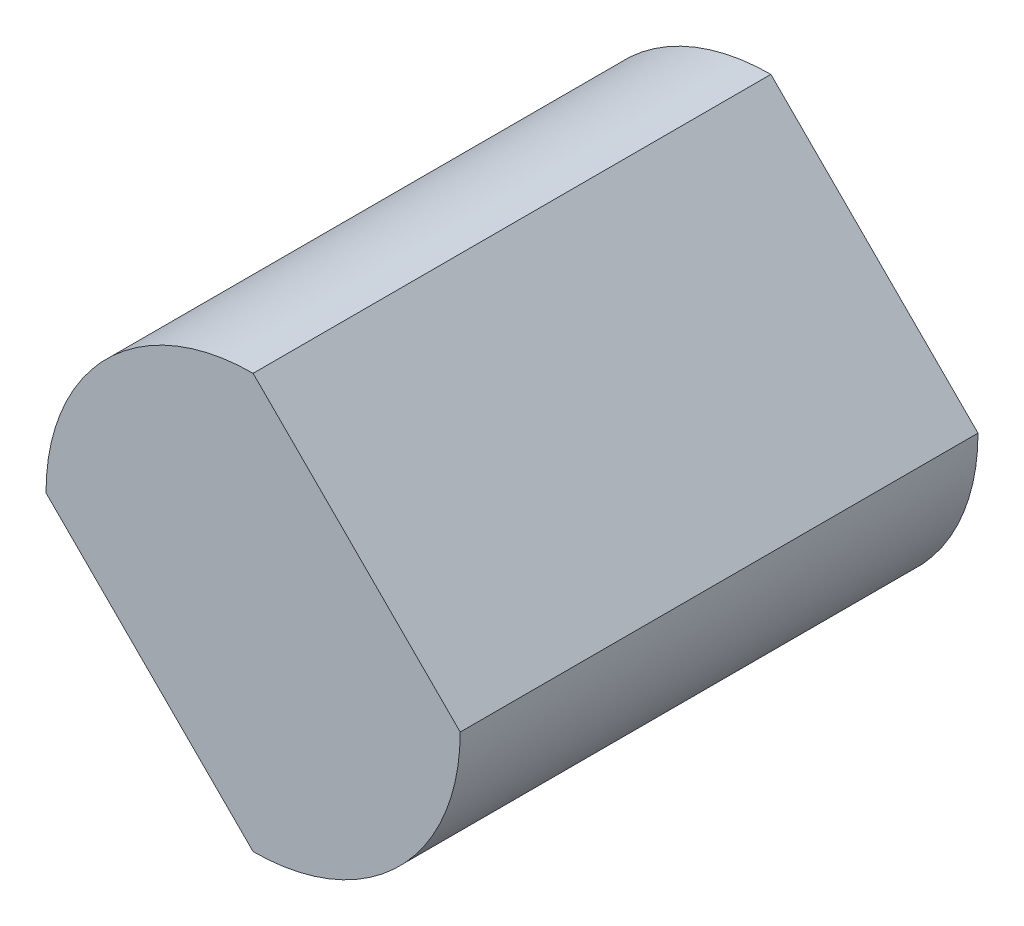
ISO-10303-21;
HEADER;
FILE_DESCRIPTION(('STEP AP214'),'2;1');
FILE_NAME('part.step','',(''),(''),'','','');
FILE_SCHEMA(('AUTOMOTIVE_DESIGN { 1 0 10303 214 1 1 1 1 }'));
ENDSEC;
DATA;
#1=APPLICATION_CONTEXT('core data for automotive mechanical design processes');
#2=APPLICATION_PROTOCOL_DEFINITION('international standard','automotive_design',2000,#1);
#3=PRODUCT_CONTEXT('',#1,'mechanical');
#4=PRODUCT('Part','Part','',(#3));
#5=PRODUCT_RELATED_PRODUCT_CATEGORY('part','',(#4));
#6=PRODUCT_DEFINITION_FORMATION('','',#4);
#7=PRODUCT_DEFINITION_CONTEXT('part definition',#1,'design');
#8=PRODUCT_DEFINITION('design','',#6,#7);
#9=PRODUCT_DEFINITION_SHAPE('','',#8);
#10=(LENGTH_UNIT() NAMED_UNIT(*) SI_UNIT(.MILLI.,.METRE.));
#11=(NAMED_UNIT(*) PLANE_ANGLE_UNIT() SI_UNIT($,.RADIAN.));
#12=(NAMED_UNIT(*) SI_UNIT($,.STERADIAN.) SOLID_ANGLE_UNIT());
#13=UNCERTAINTY_MEASURE_WITH_UNIT(LENGTH_MEASURE(1.E-05),#10,'distance_accuracy_value','');
#14=(GEOMETRIC_REPRESENTATION_CONTEXT(3) GLOBAL_UNCERTAINTY_ASSIGNED_CONTEXT((#13)) GLOBAL_UNIT_ASSIGNED_CONTEXT((#10,
#11,#12)) REPRESENTATION_CONTEXT('',''));
#15=CARTESIAN_POINT('',(0.,0.,0.));
#16=DIRECTION('',(0.,0.,1.));
#17=DIRECTION('',(1.,0.,0.));
#18=AXIS2_PLACEMENT_3D('',#15,#16,#17);
#19=CARTESIAN_POINT('',(-10.,-10.,25.));
#20=DIRECTION('',(0.707106781186548,0.707106781186547,0.));
#21=DIRECTION('',(-0.707106781186547,0.707106781186548,0.));
#22=AXIS2_PLACEMENT_3D('',#19,#20,#21);
#23=PLANE('',#22);
#24=DIRECTION('',(0.707106781186547,-0.707106781186548,0.));
#25=VECTOR('',#24,1.);
#26=CARTESIAN_POINT('',(-10.,-10.,0.));
#27=LINE('',#26,#25);
#28=CARTESIAN_POINT('',(-20.,0.,0.));
#29=VERTEX_POINT('',#28);
#30=CARTESIAN_POINT('',(-10.,-10.,0.));
#31=VERTEX_POINT('',#30);
#32=EDGE_CURVE('E98',#29,#31,#27,.T.);
#33=ORIENTED_EDGE('',*,*,#32,.T.);
#34=DIRECTION('',(0.,0.,-1.));
#35=VECTOR('',#34,1.);
#36=CARTESIAN_POINT('',(-10.,-10.,25.));
#37=LINE('',#36,#35);
#38=CARTESIAN_POINT('',(-10.,-10.,25.));
#39=VERTEX_POINT('',#38);
#40=EDGE_CURVE('E11',#39,#31,#37,.T.);
#41=ORIENTED_EDGE('',*,*,#40,.F.);
#42=DIRECTION('',(0.707106781186547,-0.707106781186548,0.));
#43=VECTOR('',#42,1.);
#44=CARTESIAN_POINT('',(-10.,-10.,25.));
#45=LINE('',#44,#43);
#46=CARTESIAN_POINT('',(-20.,0.,25.));
#47=VERTEX_POINT('',#46);
#48=EDGE_CURVE('E84',#47,#39,#45,.T.);
#49=ORIENTED_EDGE('',*,*,#48,.F.);
#50=DIRECTION('',(0.,0.,-1.));
#51=VECTOR('',#50,1.);
#52=CARTESIAN_POINT('',(-20.,0.,25.));
#53=LINE('',#52,#51);
#54=EDGE_CURVE('E51',#47,#29,#53,.T.);
#55=ORIENTED_EDGE('',*,*,#54,.T.);
#56=EDGE_LOOP('',(#33,#41,#49,#55));
#57=FACE_BOUND('',#56,.T.);
#58=ADVANCED_FACE('F35',(#57),#23,.F.);
#59=CARTESIAN_POINT('',(-10.,0.,25.));
#60=DIRECTION('',(0.,0.,-1.));
#61=DIRECTION('',(-1.,0.,0.));
#62=AXIS2_PLACEMENT_3D('',#59,#60,#61);
#63=CYLINDRICAL_SURFACE('',#62,10.);
#64=CARTESIAN_POINT('',(-10.,0.,0.));
#65=DIRECTION('',(0.,0.,1.));
#66=DIRECTION('',(1.,0.,0.));
#67=AXIS2_PLACEMENT_3D('',#64,#65,#66);
#68=CIRCLE('',#67,10.);
#69=CARTESIAN_POINT('',(0.,0.,0.));
#70=VERTEX_POINT('',#69);
#71=EDGE_CURVE('E89',#31,#70,#68,.T.);
#72=ORIENTED_EDGE('',*,*,#71,.T.);
#73=DIRECTION('',(0.,0.,-1.));
#74=VECTOR('',#73,1.);
#75=CARTESIAN_POINT('',(0.,0.,25.));
#76=LINE('',#75,#74);
#77=CARTESIAN_POINT('',(0.,0.,25.));
#78=VERTEX_POINT('',#77);
#79=EDGE_CURVE('E43',#78,#70,#76,.T.);
#80=ORIENTED_EDGE('',*,*,#79,.F.);
#81=CARTESIAN_POINT('',(-10.,0.,25.));
#82=DIRECTION('',(0.,0.,1.));
#83=DIRECTION('',(1.,0.,0.));
#84=AXIS2_PLACEMENT_3D('',#81,#82,#83);
#85=CIRCLE('',#84,10.);
#86=EDGE_CURVE('E76',#39,#78,#85,.T.);
#87=ORIENTED_EDGE('',*,*,#86,.F.);
#88=ORIENTED_EDGE('',*,*,#40,.T.);
#89=EDGE_LOOP('',(#72,#80,#87,#88));
#90=FACE_BOUND('',#89,.T.);
#91=ADVANCED_FACE('F88',(#90),#63,.T.);
#92=CARTESIAN_POINT('',(0.,0.,25.));
#93=DIRECTION('',(0.707106781186548,0.707106781186548,0.));
#94=DIRECTION('',(-0.707106781186548,0.707106781186548,0.));
#95=AXIS2_PLACEMENT_3D('',#92,#93,#94);
#96=PLANE('',#95);
#97=DIRECTION('',(0.707106781186548,-0.707106781186548,0.));
#98=VECTOR('',#97,1.);
#99=CARTESIAN_POINT('',(0.,0.,0.));
#100=LINE('',#99,#98);
#101=CARTESIAN_POINT('',(-10.,10.,0.));
#102=VERTEX_POINT('',#101);
#103=EDGE_CURVE('E101',#102,#70,#100,.T.);
#104=ORIENTED_EDGE('',*,*,#103,.F.);
#105=DIRECTION('',(0.,0.,-1.));
#106=VECTOR('',#105,1.);
#107=CARTESIAN_POINT('',(-10.,10.,25.));
#108=LINE('',#107,#106);
#109=CARTESIAN_POINT('',(-10.,10.,25.));
#110=VERTEX_POINT('',#109);
#111=EDGE_CURVE('E65',#110,#102,#108,.T.);
#112=ORIENTED_EDGE('',*,*,#111,.F.);
#113=DIRECTION('',(0.707106781186548,-0.707106781186548,0.));
#114=VECTOR('',#113,1.);
#115=CARTESIAN_POINT('',(0.,0.,25.));
#116=LINE('',#115,#114);
#117=EDGE_CURVE('E83',#110,#78,#116,.T.);
#118=ORIENTED_EDGE('',*,*,#117,.T.);
#119=ORIENTED_EDGE('',*,*,#79,.T.);
#120=EDGE_LOOP('',(#104,#112,#118,#119));
#121=FACE_BOUND('',#120,.T.);
#122=ADVANCED_FACE('F92',(#121),#96,.T.);
#123=CARTESIAN_POINT('',(-10.,0.,25.));
#124=DIRECTION('',(0.,0.,-1.));
#125=DIRECTION('',(-1.,0.,0.));
#126=AXIS2_PLACEMENT_3D('',#123,#124,#125);
#127=CYLINDRICAL_SURFACE('',#126,10.);
#128=CARTESIAN_POINT('',(-10.,0.,0.));
#129=DIRECTION('',(0.,0.,1.));
#130=DIRECTION('',(1.,0.,0.));
#131=AXIS2_PLACEMENT_3D('',#128,#129,#130);
#132=CIRCLE('',#131,10.);
#133=EDGE_CURVE('E103',#29,#102,#132,.F.);
#134=ORIENTED_EDGE('',*,*,#133,.F.);
#135=ORIENTED_EDGE('',*,*,#54,.F.);
#136=CARTESIAN_POINT('',(-10.,0.,25.));
#137=DIRECTION('',(0.,0.,1.));
#138=DIRECTION('',(1.,0.,0.));
#139=AXIS2_PLACEMENT_3D('',#136,#137,#138);
#140=CIRCLE('',#139,10.);
#141=EDGE_CURVE('E93',#47,#110,#140,.F.);
#142=ORIENTED_EDGE('',*,*,#141,.T.);
#143=ORIENTED_EDGE('',*,*,#111,.T.);
#144=EDGE_LOOP('',(#134,#135,#142,#143));
#145=FACE_BOUND('',#144,.T.);
#146=ADVANCED_FACE('F109',(#145),#127,.T.);
#147=CARTESIAN_POINT('',(0.,0.,25.));
#148=DIRECTION('',(0.,0.,1.));
#149=DIRECTION('',(1.,0.,0.));
#150=AXIS2_PLACEMENT_3D('',#147,#148,#149);
#151=PLANE('',#150);
#152=ORIENTED_EDGE('',*,*,#48,.T.);
#153=ORIENTED_EDGE('',*,*,#86,.T.);
#154=ORIENTED_EDGE('',*,*,#117,.F.);
#155=ORIENTED_EDGE('',*,*,#141,.F.);
#156=EDGE_LOOP('',(#152,#153,#154,#155));
#157=FACE_BOUND('',#156,.T.);
#158=ADVANCED_FACE('F80',(#157),#151,.T.);
#159=CARTESIAN_POINT('',(0.,0.,0.));
#160=DIRECTION('',(0.,0.,1.));
#161=DIRECTION('',(1.,0.,0.));
#162=AXIS2_PLACEMENT_3D('',#159,#160,#161);
#163=PLANE('',#162);
#164=ORIENTED_EDGE('',*,*,#32,.F.);
#165=ORIENTED_EDGE('',*,*,#133,.T.);
#166=ORIENTED_EDGE('',*,*,#103,.T.);
#167=ORIENTED_EDGE('',*,*,#71,.F.);
#168=EDGE_LOOP('',(#164,#165,#166,#167));
#169=FACE_BOUND('',#168,.T.);
#170=ADVANCED_FACE('F108',(#169),#163,.F.);
#171=CLOSED_SHELL('',(#58,#91,#122,#146,#158,#170));
#172=MANIFOLD_SOLID_BREP('B2',#171);
#173=ADVANCED_BREP_SHAPE_REPRESENTATION('',(#18,#172),#14);
#174=SHAPE_DEFINITION_REPRESENTATION(#9,#173);
ENDSEC;
END-ISO-10303-21;
